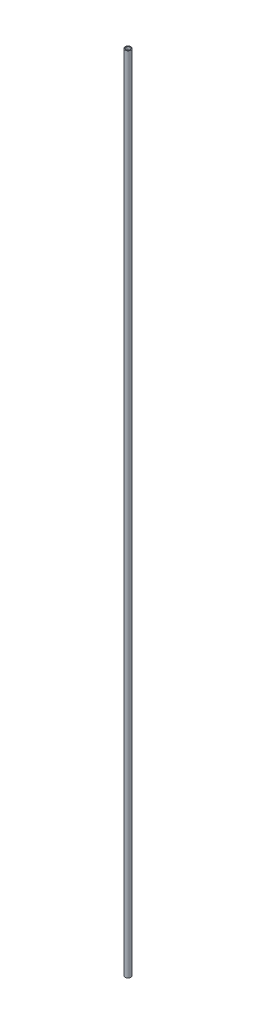
ISO-10303-21;
HEADER;
FILE_DESCRIPTION(('STEP AP214'),'2;1');
FILE_NAME('part.step','',(''),(''),'','','');
FILE_SCHEMA(('AUTOMOTIVE_DESIGN { 1 0 10303 214 1 1 1 1 }'));
ENDSEC;
DATA;
#1=APPLICATION_CONTEXT('core data for automotive mechanical design processes');
#2=APPLICATION_PROTOCOL_DEFINITION('international standard','automotive_design',2000,#1);
#3=PRODUCT_CONTEXT('',#1,'mechanical');
#4=PRODUCT('Part','Part','',(#3));
#5=PRODUCT_RELATED_PRODUCT_CATEGORY('part','',(#4));
#6=PRODUCT_DEFINITION_FORMATION('','',#4);
#7=PRODUCT_DEFINITION_CONTEXT('part definition',#1,'design');
#8=PRODUCT_DEFINITION('design','',#6,#7);
#9=PRODUCT_DEFINITION_SHAPE('','',#8);
#10=(LENGTH_UNIT() NAMED_UNIT(*) SI_UNIT(.MILLI.,.METRE.));
#11=(NAMED_UNIT(*) PLANE_ANGLE_UNIT() SI_UNIT($,.RADIAN.));
#12=(NAMED_UNIT(*) SI_UNIT($,.STERADIAN.) SOLID_ANGLE_UNIT());
#13=UNCERTAINTY_MEASURE_WITH_UNIT(LENGTH_MEASURE(1.E-05),#10,'distance_accuracy_value','');
#14=(GEOMETRIC_REPRESENTATION_CONTEXT(3) GLOBAL_UNCERTAINTY_ASSIGNED_CONTEXT((#13)) GLOBAL_UNIT_ASSIGNED_CONTEXT((#10,
#11,#12)) REPRESENTATION_CONTEXT('',''));
#15=CARTESIAN_POINT('',(0.,0.,0.));
#16=DIRECTION('',(0.,0.,1.));
#17=DIRECTION('',(1.,0.,0.));
#18=AXIS2_PLACEMENT_3D('',#15,#16,#17);
#19=CARTESIAN_POINT('',(0.,18.,0.));
#20=DIRECTION('',(0.,1.,0.));
#21=DIRECTION('',(0.,0.,1.));
#22=AXIS2_PLACEMENT_3D('',#19,#20,#21);
#23=PLANE('',#22);
#24=CARTESIAN_POINT('',(0.,18.,0.));
#25=DIRECTION('',(0.,1.,0.));
#26=DIRECTION('',(0.,0.,1.));
#27=AXIS2_PLACEMENT_3D('',#24,#25,#26);
#28=CIRCLE('',#27,0.06604);
#29=CARTESIAN_POINT('',(0.,18.,0.06604));
#30=VERTEX_POINT('',#29);
#31=EDGE_CURVE('E10',#30,#30,#28,.T.);
#32=ORIENTED_EDGE('',*,*,#31,.T.);
#33=EDGE_LOOP('',(#32));
#34=FACE_BOUND('',#33,.T.);
#35=CARTESIAN_POINT('',(0.,18.,0.));
#36=DIRECTION('',(0.,1.,0.));
#37=DIRECTION('',(0.,0.,1.));
#38=AXIS2_PLACEMENT_3D('',#35,#36,#37);
#39=CIRCLE('',#38,0.04826);
#40=CARTESIAN_POINT('',(0.,18.,0.04826));
#41=VERTEX_POINT('',#40);
#42=EDGE_CURVE('E42',#41,#41,#39,.T.);
#43=ORIENTED_EDGE('',*,*,#42,.F.);
#44=EDGE_LOOP('',(#43));
#45=FACE_BOUND('',#44,.T.);
#46=ADVANCED_FACE('F31',(#34,#45),#23,.T.);
#47=CARTESIAN_POINT('',(0.,0.,0.));
#48=DIRECTION('',(0.,1.,0.));
#49=DIRECTION('',(0.,0.,1.));
#50=AXIS2_PLACEMENT_3D('',#47,#48,#49);
#51=PLANE('',#50);
#52=CARTESIAN_POINT('',(0.,0.,0.));
#53=DIRECTION('',(0.,1.,0.));
#54=DIRECTION('',(0.,0.,1.));
#55=AXIS2_PLACEMENT_3D('',#52,#53,#54);
#56=CIRCLE('',#55,0.06604);
#57=CARTESIAN_POINT('',(0.,0.,0.06604));
#58=VERTEX_POINT('',#57);
#59=EDGE_CURVE('E35',#58,#58,#56,.T.);
#60=ORIENTED_EDGE('',*,*,#59,.F.);
#61=EDGE_LOOP('',(#60));
#62=FACE_BOUND('',#61,.T.);
#63=CARTESIAN_POINT('',(0.,0.,0.));
#64=DIRECTION('',(0.,1.,0.));
#65=DIRECTION('',(0.,0.,1.));
#66=AXIS2_PLACEMENT_3D('',#63,#64,#65);
#67=CIRCLE('',#66,0.04826);
#68=CARTESIAN_POINT('',(0.,0.,0.04826));
#69=VERTEX_POINT('',#68);
#70=EDGE_CURVE('E44',#69,#69,#67,.T.);
#71=ORIENTED_EDGE('',*,*,#70,.T.);
#72=EDGE_LOOP('',(#71));
#73=FACE_BOUND('',#72,.T.);
#74=ADVANCED_FACE('F54',(#62,#73),#51,.F.);
#75=CARTESIAN_POINT('',(0.,18.,0.));
#76=DIRECTION('',(0.,-1.,0.));
#77=DIRECTION('',(0.,0.,-1.));
#78=AXIS2_PLACEMENT_3D('',#75,#76,#77);
#79=CYLINDRICAL_SURFACE('',#78,0.06604);
#80=ORIENTED_EDGE('',*,*,#31,.F.);
#81=EDGE_LOOP('',(#80));
#82=FACE_BOUND('',#81,.T.);
#83=ORIENTED_EDGE('',*,*,#59,.T.);
#84=EDGE_LOOP('',(#83));
#85=FACE_BOUND('',#84,.T.);
#86=ADVANCED_FACE('F33',(#82,#85),#79,.T.);
#87=CARTESIAN_POINT('',(0.,18.,0.));
#88=DIRECTION('',(0.,-1.,0.));
#89=DIRECTION('',(0.,0.,-1.));
#90=AXIS2_PLACEMENT_3D('',#87,#88,#89);
#91=CYLINDRICAL_SURFACE('',#90,0.04826);
#92=ORIENTED_EDGE('',*,*,#42,.T.);
#93=EDGE_LOOP('',(#92));
#94=FACE_BOUND('',#93,.T.);
#95=ORIENTED_EDGE('',*,*,#70,.F.);
#96=EDGE_LOOP('',(#95));
#97=FACE_BOUND('',#96,.T.);
#98=ADVANCED_FACE('F50',(#94,#97),#91,.F.);
#99=CLOSED_SHELL('',(#46,#74,#86,#98));
#100=MANIFOLD_SOLID_BREP('B2',#99);
#101=ADVANCED_BREP_SHAPE_REPRESENTATION('',(#18,#100),#14);
#102=SHAPE_DEFINITION_REPRESENTATION(#9,#101);
ENDSEC;
END-ISO-10303-21;
